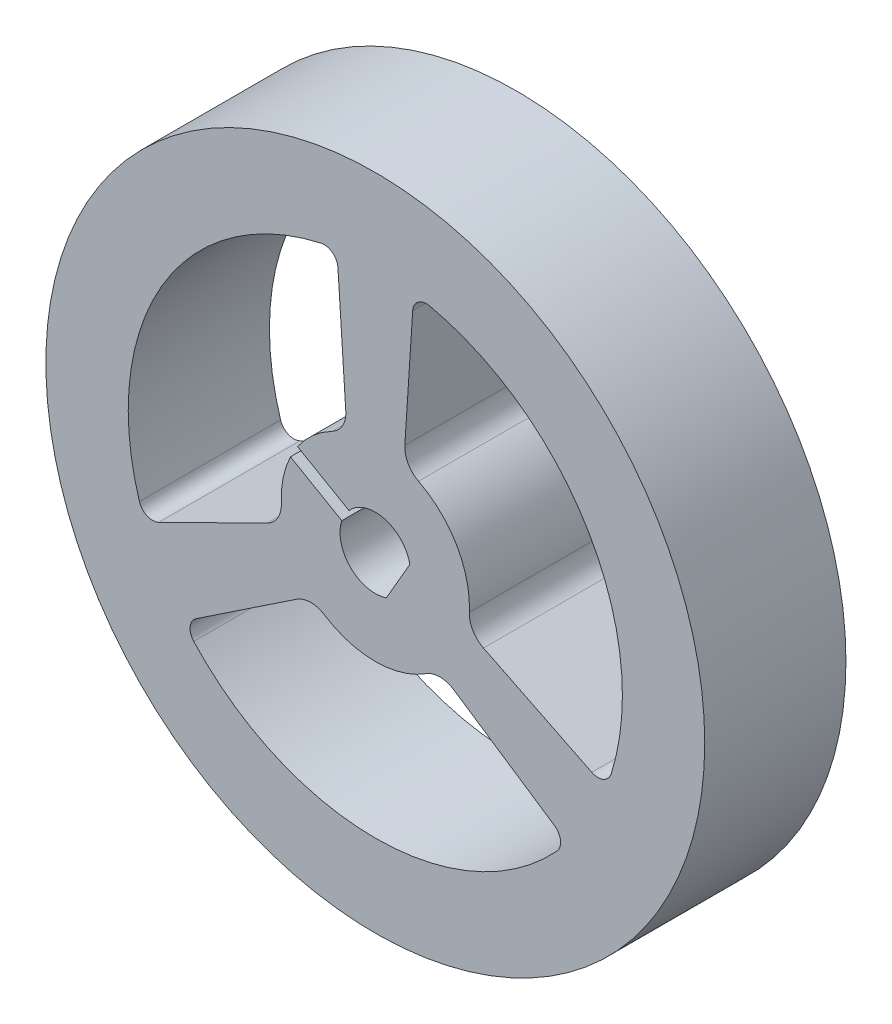
ISO-10303-21;
HEADER;
FILE_DESCRIPTION(('STEP AP214'),'2;1');
FILE_NAME('part.step','',(''),(''),'','','');
FILE_SCHEMA(('AUTOMOTIVE_DESIGN { 1 0 10303 214 1 1 1 1 }'));
ENDSEC;
DATA;
#1=APPLICATION_CONTEXT('core data for automotive mechanical design processes');
#2=APPLICATION_PROTOCOL_DEFINITION('international standard','automotive_design',2000,#1);
#3=PRODUCT_CONTEXT('',#1,'mechanical');
#4=PRODUCT('Part','Part','',(#3));
#5=PRODUCT_RELATED_PRODUCT_CATEGORY('part','',(#4));
#6=PRODUCT_DEFINITION_FORMATION('','',#4);
#7=PRODUCT_DEFINITION_CONTEXT('part definition',#1,'design');
#8=PRODUCT_DEFINITION('design','',#6,#7);
#9=PRODUCT_DEFINITION_SHAPE('','',#8);
#10=(LENGTH_UNIT() NAMED_UNIT(*) SI_UNIT(.MILLI.,.METRE.));
#11=(NAMED_UNIT(*) PLANE_ANGLE_UNIT() SI_UNIT($,.RADIAN.));
#12=(NAMED_UNIT(*) SI_UNIT($,.STERADIAN.) SOLID_ANGLE_UNIT());
#13=UNCERTAINTY_MEASURE_WITH_UNIT(LENGTH_MEASURE(1.E-05),#10,'distance_accuracy_value','');
#14=(GEOMETRIC_REPRESENTATION_CONTEXT(3) GLOBAL_UNCERTAINTY_ASSIGNED_CONTEXT((#13)) GLOBAL_UNIT_ASSIGNED_CONTEXT((#10,
#11,#12)) REPRESENTATION_CONTEXT('',''));
#15=CARTESIAN_POINT('',(0.,0.,0.));
#16=DIRECTION('',(0.,0.,1.));
#17=DIRECTION('',(1.,0.,0.));
#18=AXIS2_PLACEMENT_3D('',#15,#16,#17);
#19=CARTESIAN_POINT('',(0.,0.,6.));
#20=DIRECTION('',(0.,0.,1.));
#21=DIRECTION('',(1.,0.,0.));
#22=AXIS2_PLACEMENT_3D('',#19,#20,#21);
#23=PLANE('',#22);
#24=CARTESIAN_POINT('',(0.,0.,6.));
#25=DIRECTION('',(0.,0.,1.));
#26=DIRECTION('',(1.,0.,0.));
#27=AXIS2_PLACEMENT_3D('',#24,#25,#26);
#28=CIRCLE('',#27,14.);
#29=CARTESIAN_POINT('',(14.,0.,6.));
#30=VERTEX_POINT('',#29);
#31=EDGE_CURVE('E11',#30,#30,#28,.T.);
#32=ORIENTED_EDGE('',*,*,#31,.T.);
#33=EDGE_LOOP('',(#32));
#34=FACE_BOUND('',#33,.T.);
#35=DIRECTION('',(-0.0650528700839006,0.997881818700916,0.));
#36=VECTOR('',#35,1.);
#37=CARTESIAN_POINT('',(-1.25469994287573,4.58371108591973,6.));
#38=LINE('',#37,#36);
#39=CARTESIAN_POINT('',(-1.25469994287573,4.58371108591973,6.));
#40=VERTEX_POINT('',#39);
#41=CARTESIAN_POINT('',(-1.58860741176412,9.70570173602358,6.));
#42=VERTEX_POINT('',#41);
#43=EDGE_CURVE('E359',#40,#42,#38,.T.);
#44=ORIENTED_EDGE('',*,*,#43,.F.);
#45=CARTESIAN_POINT('',(-2.33323358140276,4.51340044657011,6.));
#46=DIRECTION('',(0.,0.,1.));
#47=DIRECTION('',(1.,0.,0.));
#48=AXIS2_PLACEMENT_3D('',#45,#46,#47);
#49=CIRCLE('',#48,1.08082301763059);
#50=CARTESIAN_POINT('',(-1.8368941986811,3.55328294719851,6.));
#51=VERTEX_POINT('',#50);
#52=EDGE_CURVE('E357',#51,#40,#49,.T.);
#53=ORIENTED_EDGE('',*,*,#52,.F.);
#54=CARTESIAN_POINT('',(0.,0.,6.));
#55=DIRECTION('',(0.,0.,-1.));
#56=DIRECTION('',(1.,0.,0.));
#57=AXIS2_PLACEMENT_3D('',#54,#55,#56);
#58=CIRCLE('',#57,4.);
#59=CARTESIAN_POINT('',(-3.30233206686227,2.25712270826669,6.));
#60=VERTEX_POINT('',#59);
#61=EDGE_CURVE('E385',#60,#51,#58,.T.);
#62=ORIENTED_EDGE('',*,*,#61,.F.);
#63=DIRECTION('',(-0.866025403784439,0.5,0.));
#64=VECTOR('',#63,1.);
#65=CARTESIAN_POINT('',(-1.12037928060492,0.99737167976196,6.));
#66=LINE('',#65,#64);
#67=CARTESIAN_POINT('',(-1.12037928060492,0.997371679761959,6.));
#68=VERTEX_POINT('',#67);
#69=EDGE_CURVE('E382',#68,#60,#66,.T.);
#70=ORIENTED_EDGE('',*,*,#69,.F.);
#71=CARTESIAN_POINT('',(0.,0.,6.));
#72=DIRECTION('',(0.,0.,1.));
#73=DIRECTION('',(1.,0.,0.));
#74=AXIS2_PLACEMENT_3D('',#71,#72,#73);
#75=CIRCLE('',#74,1.5);
#76=CARTESIAN_POINT('',(1.46824583655185,0.307008409409491,6.));
#77=VERTEX_POINT('',#76);
#78=EDGE_CURVE('E380',#77,#68,#75,.T.);
#79=ORIENTED_EDGE('',*,*,#78,.F.);
#80=DIRECTION('',(0.5,0.866025403784439,0.));
#81=VECTOR('',#80,1.);
#82=CARTESIAN_POINT('',(1.46824583655185,0.307008409409491,6.));
#83=LINE('',#82,#81);
#84=CARTESIAN_POINT('',(0.468245836551854,-1.42504239815939,6.));
#85=VERTEX_POINT('',#84);
#86=EDGE_CURVE('E378',#85,#77,#83,.T.);
#87=ORIENTED_EDGE('',*,*,#86,.F.);
#88=CARTESIAN_POINT('',(0.,0.,6.));
#89=DIRECTION('',(0.,0.,1.));
#90=DIRECTION('',(1.,0.,0.));
#91=AXIS2_PLACEMENT_3D('',#88,#89,#90);
#92=CIRCLE('',#91,1.5);
#93=CARTESIAN_POINT('',(-1.42393885199148,0.471591078996618,6.));
#94=VERTEX_POINT('',#93);
#95=EDGE_CURVE('E376',#94,#85,#92,.T.);
#96=ORIENTED_EDGE('',*,*,#95,.F.);
#97=DIRECTION('',(0.866025403784438,-0.5,0.));
#98=VECTOR('',#97,1.);
#99=CARTESIAN_POINT('',(-1.42393885199148,0.471591078996618,6.));
#100=LINE('',#99,#98);
#101=CARTESIAN_POINT('',(-3.60589163824882,1.73134210750135,6.));
#102=VERTEX_POINT('',#101);
#103=EDGE_CURVE('E374',#102,#94,#100,.T.);
#104=ORIENTED_EDGE('',*,*,#103,.F.);
#105=CARTESIAN_POINT('',(0.,0.,6.));
#106=DIRECTION('',(0.,0.,-1.));
#107=DIRECTION('',(1.,0.,0.));
#108=AXIS2_PLACEMENT_3D('',#105,#106,#107);
#109=CIRCLE('',#108,4.);
#110=CARTESIAN_POINT('',(-3.9956803984485,-0.185844433477162,6.));
#111=VERTEX_POINT('',#110);
#112=EDGE_CURVE('E372',#111,#102,#109,.T.);
#113=ORIENTED_EDGE('',*,*,#112,.F.);
#114=CARTESIAN_POINT('',(-5.07533623488313,-0.236060668827324,6.));
#115=DIRECTION('',(0.,0.,1.));
#116=DIRECTION('',(-1.,0.,0.));
#117=AXIS2_PLACEMENT_3D('',#114,#115,#116);
#118=CIRCLE('',#117,1.08082301763059);
#119=CARTESIAN_POINT('',(-4.5969602154527,-1.2052535183026,6.));
#120=VERTEX_POINT('',#119);
#121=EDGE_CURVE('E370',#120,#111,#118,.T.);
#122=ORIENTED_EDGE('',*,*,#121,.F.);
#123=DIRECTION('',(0.896717440011561,0.442603471268711,0.));
#124=VECTOR('',#123,1.);
#125=CARTESIAN_POINT('',(-4.5969602154527,-1.2052535183026,6.));
#126=LINE('',#125,#124);
#127=CARTESIAN_POINT('',(-9.19968797083321,-3.47707649278383,6.));
#128=VERTEX_POINT('',#127);
#129=EDGE_CURVE('E368',#128,#120,#126,.T.);
#130=ORIENTED_EDGE('',*,*,#129,.F.);
#131=CARTESIAN_POINT('',(-9.46101968490718,-2.94761678256847,6.));
#132=DIRECTION('',(0.,0.,1.));
#133=DIRECTION('',(-1.,0.,0.));
#134=AXIS2_PLACEMENT_3D('',#131,#132,#133);
#135=CIRCLE('',#134,0.590442079735321);
#136=CARTESIAN_POINT('',(-10.0247364706732,-3.12324489810764,6.));
#137=VERTEX_POINT('',#136);
#138=EDGE_CURVE('E366',#137,#128,#135,.T.);
#139=ORIENTED_EDGE('',*,*,#138,.F.);
#140=CARTESIAN_POINT('',(0.,0.,6.));
#141=DIRECTION('',(0.,0.,1.));
#142=DIRECTION('',(1.,0.,0.));
#143=AXIS2_PLACEMENT_3D('',#140,#141,#142);
#144=CIRCLE('',#143,10.5);
#145=CARTESIAN_POINT('',(-2.30755881133522,10.2432988989011,6.));
#146=VERTEX_POINT('',#145);
#147=EDGE_CURVE('E364',#146,#137,#144,.T.);
#148=ORIENTED_EDGE('',*,*,#147,.F.);
#149=CARTESIAN_POINT('',(-2.17779882812795,9.66729178411849,6.));
#150=DIRECTION('',(0.,0.,1.));
#151=DIRECTION('',(1.,0.,0.));
#152=AXIS2_PLACEMENT_3D('',#149,#150,#151);
#153=CIRCLE('',#152,0.590442079735324);
#154=EDGE_CURVE('E362',#42,#146,#153,.T.);
#155=ORIENTED_EDGE('',*,*,#154,.F.);
#156=EDGE_LOOP('',(#44,#53,#62,#70,#79,#87,#96,#104,#113,#122,#130,#139,#148,#155));
#157=FACE_BOUND('',#156,.T.);
#158=CARTESIAN_POINT('',(5.07533623488313,-0.236060668827315,6.));
#159=DIRECTION('',(0.,0.,1.));
#160=DIRECTION('',(1.,0.,0.));
#161=AXIS2_PLACEMENT_3D('',#158,#159,#160);
#162=CIRCLE('',#161,1.08082301763059);
#163=CARTESIAN_POINT('',(3.9956803984485,-0.18584443347716,6.));
#164=VERTEX_POINT('',#163);
#165=CARTESIAN_POINT('',(4.5969602154527,-1.20525351830259,6.));
#166=VERTEX_POINT('',#165);
#167=EDGE_CURVE('E300',#164,#166,#162,.T.);
#168=ORIENTED_EDGE('',*,*,#167,.F.);
#169=CARTESIAN_POINT('',(0.,0.,6.));
#170=DIRECTION('',(0.,0.,-1.));
#171=DIRECTION('',(1.,0.,0.));
#172=AXIS2_PLACEMENT_3D('',#169,#170,#171);
#173=CIRCLE('',#172,4.);
#174=CARTESIAN_POINT('',(1.8368941986811,3.55328294719851,6.));
#175=VERTEX_POINT('',#174);
#176=EDGE_CURVE('E298',#175,#164,#173,.T.);
#177=ORIENTED_EDGE('',*,*,#176,.F.);
#178=CARTESIAN_POINT('',(2.33323358140276,4.51340044657011,6.));
#179=DIRECTION('',(0.,0.,1.));
#180=DIRECTION('',(-1.,0.,0.));
#181=AXIS2_PLACEMENT_3D('',#178,#179,#180);
#182=CIRCLE('',#181,1.08082301763059);
#183=CARTESIAN_POINT('',(1.25469994287573,4.58371108591973,6.));
#184=VERTEX_POINT('',#183);
#185=EDGE_CURVE('E314',#184,#175,#182,.T.);
#186=ORIENTED_EDGE('',*,*,#185,.F.);
#187=DIRECTION('',(-0.0650528700839006,-0.997881818700916,0.));
#188=VECTOR('',#187,1.);
#189=CARTESIAN_POINT('',(1.25469994287573,4.58371108591973,6.));
#190=LINE('',#189,#188);
#191=CARTESIAN_POINT('',(1.58860741176412,9.70570173602358,6.));
#192=VERTEX_POINT('',#191);
#193=EDGE_CURVE('E311',#192,#184,#190,.T.);
#194=ORIENTED_EDGE('',*,*,#193,.F.);
#195=CARTESIAN_POINT('',(2.17779882812795,9.66729178411849,6.));
#196=DIRECTION('',(0.,0.,1.));
#197=DIRECTION('',(-1.,0.,0.));
#198=AXIS2_PLACEMENT_3D('',#195,#196,#197);
#199=CIRCLE('',#198,0.590442079735324);
#200=CARTESIAN_POINT('',(2.30755881133522,10.2432988989011,6.));
#201=VERTEX_POINT('',#200);
#202=EDGE_CURVE('E309',#201,#192,#199,.T.);
#203=ORIENTED_EDGE('',*,*,#202,.F.);
#204=CARTESIAN_POINT('',(0.,0.,6.));
#205=DIRECTION('',(0.,0.,1.));
#206=DIRECTION('',(1.,0.,0.));
#207=AXIS2_PLACEMENT_3D('',#204,#205,#206);
#208=CIRCLE('',#207,10.5);
#209=CARTESIAN_POINT('',(10.0247364706732,-3.12324489810764,6.));
#210=VERTEX_POINT('',#209);
#211=EDGE_CURVE('E307',#210,#201,#208,.T.);
#212=ORIENTED_EDGE('',*,*,#211,.F.);
#213=CARTESIAN_POINT('',(9.46101968490718,-2.94761678256846,6.));
#214=DIRECTION('',(0.,0.,1.));
#215=DIRECTION('',(1.,0.,0.));
#216=AXIS2_PLACEMENT_3D('',#213,#214,#215);
#217=CIRCLE('',#216,0.590442079735323);
#218=CARTESIAN_POINT('',(9.19968797083321,-3.47707649278382,6.));
#219=VERTEX_POINT('',#218);
#220=EDGE_CURVE('E305',#219,#210,#217,.T.);
#221=ORIENTED_EDGE('',*,*,#220,.F.);
#222=DIRECTION('',(0.896717440011561,-0.442603471268711,0.));
#223=VECTOR('',#222,1.);
#224=CARTESIAN_POINT('',(4.5969602154527,-1.20525351830259,6.));
#225=LINE('',#224,#223);
#226=EDGE_CURVE('E303',#166,#219,#225,.T.);
#227=ORIENTED_EDGE('',*,*,#226,.F.);
#228=EDGE_LOOP('',(#168,#177,#186,#194,#203,#212,#221,#227));
#229=FACE_BOUND('',#228,.T.);
#230=CARTESIAN_POINT('',(-2.74210265348037,-4.2773397777428,6.));
#231=DIRECTION('',(0.,0.,1.));
#232=DIRECTION('',(1.,0.,0.));
#233=AXIS2_PLACEMENT_3D('',#230,#231,#232);
#234=CIRCLE('',#233,1.08082301763059);
#235=CARTESIAN_POINT('',(-2.1587861997674,-3.36743851372135,6.));
#236=VERTEX_POINT('',#235);
#237=CARTESIAN_POINT('',(-3.34226027257697,-3.37845756761713,6.));
#238=VERTEX_POINT('',#237);
#239=EDGE_CURVE('E241',#236,#238,#234,.T.);
#240=ORIENTED_EDGE('',*,*,#239,.F.);
#241=CARTESIAN_POINT('',(0.,0.,6.));
#242=DIRECTION('',(0.,0.,-1.));
#243=DIRECTION('',(1.,0.,0.));
#244=AXIS2_PLACEMENT_3D('',#241,#242,#243);
#245=CIRCLE('',#244,4.);
#246=CARTESIAN_POINT('',(2.1587861997674,-3.36743851372135,6.));
#247=VERTEX_POINT('',#246);
#248=EDGE_CURVE('E233',#247,#236,#245,.T.);
#249=ORIENTED_EDGE('',*,*,#248,.F.);
#250=CARTESIAN_POINT('',(2.74210265348037,-4.27733977774279,6.));
#251=DIRECTION('',(0.,0.,1.));
#252=DIRECTION('',(-1.,0.,0.));
#253=AXIS2_PLACEMENT_3D('',#250,#251,#252);
#254=CIRCLE('',#253,1.08082301763059);
#255=CARTESIAN_POINT('',(3.34226027257697,-3.37845756761713,6.));
#256=VERTEX_POINT('',#255);
#257=EDGE_CURVE('E266',#256,#247,#254,.T.);
#258=ORIENTED_EDGE('',*,*,#257,.F.);
#259=DIRECTION('',(-0.83166456992766,0.555278347432204,0.));
#260=VECTOR('',#259,1.);
#261=CARTESIAN_POINT('',(3.34226027257697,-3.37845756761713,6.));
#262=LINE('',#261,#260);
#263=CARTESIAN_POINT('',(7.6110805590691,-6.22862524323976,6.));
#264=VERTEX_POINT('',#263);
#265=EDGE_CURVE('E264',#264,#256,#262,.T.);
#266=ORIENTED_EDGE('',*,*,#265,.F.);
#267=CARTESIAN_POINT('',(7.28322085677923,-6.71967500155003,6.));
#268=DIRECTION('',(0.,0.,1.));
#269=DIRECTION('',(-1.,0.,0.));
#270=AXIS2_PLACEMENT_3D('',#267,#268,#269);
#271=CIRCLE('',#270,0.590442079735324);
#272=CARTESIAN_POINT('',(7.71717765933794,-7.12005400079349,6.));
#273=VERTEX_POINT('',#272);
#274=EDGE_CURVE('E262',#273,#264,#271,.T.);
#275=ORIENTED_EDGE('',*,*,#274,.F.);
#276=CARTESIAN_POINT('',(0.,0.,6.));
#277=DIRECTION('',(0.,0.,1.));
#278=DIRECTION('',(1.,0.,0.));
#279=AXIS2_PLACEMENT_3D('',#276,#277,#278);
#280=CIRCLE('',#279,10.5);
#281=CARTESIAN_POINT('',(-7.71717765933794,-7.1200540007935,6.));
#282=VERTEX_POINT('',#281);
#283=EDGE_CURVE('E260',#282,#273,#280,.T.);
#284=ORIENTED_EDGE('',*,*,#283,.F.);
#285=CARTESIAN_POINT('',(-7.28322085677923,-6.71967500155004,6.));
#286=DIRECTION('',(0.,0.,1.));
#287=DIRECTION('',(1.,0.,0.));
#288=AXIS2_PLACEMENT_3D('',#285,#286,#287);
#289=CIRCLE('',#288,0.590442079735324);
#290=CARTESIAN_POINT('',(-7.61108055906909,-6.22862524323977,6.));
#291=VERTEX_POINT('',#290);
#292=EDGE_CURVE('E256',#291,#282,#289,.T.);
#293=ORIENTED_EDGE('',*,*,#292,.F.);
#294=DIRECTION('',(-0.83166456992766,-0.555278347432205,0.));
#295=VECTOR('',#294,1.);
#296=CARTESIAN_POINT('',(-3.34226027257697,-3.37845756761713,6.));
#297=LINE('',#296,#295);
#298=EDGE_CURVE('E254',#238,#291,#297,.T.);
#299=ORIENTED_EDGE('',*,*,#298,.F.);
#300=EDGE_LOOP('',(#240,#249,#258,#266,#275,#284,#293,#299));
#301=FACE_BOUND('',#300,.T.);
#302=ADVANCED_FACE('F36',(#34,#157,#229,#301),#23,.T.);
#303=CARTESIAN_POINT('',(0.,0.,0.));
#304=DIRECTION('',(0.,0.,1.));
#305=DIRECTION('',(1.,0.,0.));
#306=AXIS2_PLACEMENT_3D('',#303,#304,#305);
#307=PLANE('',#306);
#308=CARTESIAN_POINT('',(0.,0.,0.));
#309=DIRECTION('',(0.,0.,-1.));
#310=DIRECTION('',(1.,0.,0.));
#311=AXIS2_PLACEMENT_3D('',#308,#309,#310);
#312=CIRCLE('',#311,4.);
#313=CARTESIAN_POINT('',(1.8368941986811,3.55328294719851,0.));
#314=VERTEX_POINT('',#313);
#315=CARTESIAN_POINT('',(3.9956803984485,-0.18584443347716,0.));
#316=VERTEX_POINT('',#315);
#317=EDGE_CURVE('E249',#314,#316,#312,.T.);
#318=ORIENTED_EDGE('',*,*,#317,.T.);
#319=CARTESIAN_POINT('',(5.07533623488313,-0.236060668827315,0.));
#320=DIRECTION('',(0.,0.,1.));
#321=DIRECTION('',(1.,0.,0.));
#322=AXIS2_PLACEMENT_3D('',#319,#320,#321);
#323=CIRCLE('',#322,1.08082301763059);
#324=CARTESIAN_POINT('',(4.5969602154527,-1.20525351830259,0.));
#325=VERTEX_POINT('',#324);
#326=EDGE_CURVE('E319',#316,#325,#323,.T.);
#327=ORIENTED_EDGE('',*,*,#326,.T.);
#328=DIRECTION('',(0.896717440011561,-0.442603471268711,0.));
#329=VECTOR('',#328,1.);
#330=CARTESIAN_POINT('',(4.5969602154527,-1.20525351830259,0.));
#331=LINE('',#330,#329);
#332=CARTESIAN_POINT('',(9.19968797083321,-3.47707649278382,0.));
#333=VERTEX_POINT('',#332);
#334=EDGE_CURVE('E322',#325,#333,#331,.T.);
#335=ORIENTED_EDGE('',*,*,#334,.T.);
#336=CARTESIAN_POINT('',(9.46101968490718,-2.94761678256846,0.));
#337=DIRECTION('',(0.,0.,1.));
#338=DIRECTION('',(1.,0.,0.));
#339=AXIS2_PLACEMENT_3D('',#336,#337,#338);
#340=CIRCLE('',#339,0.590442079735323);
#341=CARTESIAN_POINT('',(10.0247364706732,-3.12324489810764,0.));
#342=VERTEX_POINT('',#341);
#343=EDGE_CURVE('E325',#333,#342,#340,.T.);
#344=ORIENTED_EDGE('',*,*,#343,.T.);
#345=CARTESIAN_POINT('',(0.,0.,0.));
#346=DIRECTION('',(0.,0.,1.));
#347=DIRECTION('',(1.,0.,0.));
#348=AXIS2_PLACEMENT_3D('',#345,#346,#347);
#349=CIRCLE('',#348,10.5);
#350=CARTESIAN_POINT('',(2.30755881133522,10.2432988989011,0.));
#351=VERTEX_POINT('',#350);
#352=EDGE_CURVE('E328',#342,#351,#349,.T.);
#353=ORIENTED_EDGE('',*,*,#352,.T.);
#354=CARTESIAN_POINT('',(2.17779882812795,9.66729178411849,0.));
#355=DIRECTION('',(0.,0.,1.));
#356=DIRECTION('',(-1.,0.,0.));
#357=AXIS2_PLACEMENT_3D('',#354,#355,#356);
#358=CIRCLE('',#357,0.590442079735324);
#359=CARTESIAN_POINT('',(1.58860741176412,9.70570173602358,0.));
#360=VERTEX_POINT('',#359);
#361=EDGE_CURVE('E331',#351,#360,#358,.T.);
#362=ORIENTED_EDGE('',*,*,#361,.T.);
#363=DIRECTION('',(-0.0650528700839006,-0.997881818700916,0.));
#364=VECTOR('',#363,1.);
#365=CARTESIAN_POINT('',(1.25469994287573,4.58371108591973,0.));
#366=LINE('',#365,#364);
#367=CARTESIAN_POINT('',(1.25469994287573,4.58371108591973,0.));
#368=VERTEX_POINT('',#367);
#369=EDGE_CURVE('E334',#360,#368,#366,.T.);
#370=ORIENTED_EDGE('',*,*,#369,.T.);
#371=CARTESIAN_POINT('',(2.33323358140276,4.51340044657011,0.));
#372=DIRECTION('',(0.,0.,1.));
#373=DIRECTION('',(-1.,0.,0.));
#374=AXIS2_PLACEMENT_3D('',#371,#372,#373);
#375=CIRCLE('',#374,1.08082301763059);
#376=EDGE_CURVE('E301',#368,#314,#375,.T.);
#377=ORIENTED_EDGE('',*,*,#376,.T.);
#378=EDGE_LOOP('',(#318,#327,#335,#344,#353,#362,#370,#377));
#379=FACE_BOUND('',#378,.T.);
#380=CARTESIAN_POINT('',(0.,0.,0.));
#381=DIRECTION('',(0.,0.,1.));
#382=DIRECTION('',(1.,0.,0.));
#383=AXIS2_PLACEMENT_3D('',#380,#381,#382);
#384=CIRCLE('',#383,14.);
#385=CARTESIAN_POINT('',(14.,0.,0.));
#386=VERTEX_POINT('',#385);
#387=EDGE_CURVE('E40',#386,#386,#384,.T.);
#388=ORIENTED_EDGE('',*,*,#387,.F.);
#389=EDGE_LOOP('',(#388));
#390=FACE_BOUND('',#389,.T.);
#391=CARTESIAN_POINT('',(-2.33323358140276,4.51340044657011,0.));
#392=DIRECTION('',(0.,0.,1.));
#393=DIRECTION('',(1.,0.,0.));
#394=AXIS2_PLACEMENT_3D('',#391,#392,#393);
#395=CIRCLE('',#394,1.08082301763059);
#396=CARTESIAN_POINT('',(-1.8368941986811,3.55328294719851,0.));
#397=VERTEX_POINT('',#396);
#398=CARTESIAN_POINT('',(-1.25469994287573,4.58371108591973,0.));
#399=VERTEX_POINT('',#398);
#400=EDGE_CURVE('E356',#397,#399,#395,.T.);
#401=ORIENTED_EDGE('',*,*,#400,.T.);
#402=DIRECTION('',(-0.0650528700839006,0.997881818700916,0.));
#403=VECTOR('',#402,1.);
#404=CARTESIAN_POINT('',(-1.25469994287573,4.58371108591973,0.));
#405=LINE('',#404,#403);
#406=CARTESIAN_POINT('',(-1.58860741176412,9.70570173602358,0.));
#407=VERTEX_POINT('',#406);
#408=EDGE_CURVE('E390',#399,#407,#405,.T.);
#409=ORIENTED_EDGE('',*,*,#408,.T.);
#410=CARTESIAN_POINT('',(-2.17779882812795,9.66729178411849,0.));
#411=DIRECTION('',(0.,0.,1.));
#412=DIRECTION('',(1.,0.,0.));
#413=AXIS2_PLACEMENT_3D('',#410,#411,#412);
#414=CIRCLE('',#413,0.590442079735324);
#415=CARTESIAN_POINT('',(-2.30755881133522,10.2432988989011,0.));
#416=VERTEX_POINT('',#415);
#417=EDGE_CURVE('E393',#407,#416,#414,.T.);
#418=ORIENTED_EDGE('',*,*,#417,.T.);
#419=CARTESIAN_POINT('',(0.,0.,0.));
#420=DIRECTION('',(0.,0.,1.));
#421=DIRECTION('',(1.,0.,0.));
#422=AXIS2_PLACEMENT_3D('',#419,#420,#421);
#423=CIRCLE('',#422,10.5);
#424=CARTESIAN_POINT('',(-10.0247364706732,-3.12324489810764,0.));
#425=VERTEX_POINT('',#424);
#426=EDGE_CURVE('E396',#416,#425,#423,.T.);
#427=ORIENTED_EDGE('',*,*,#426,.T.);
#428=CARTESIAN_POINT('',(-9.46101968490718,-2.94761678256847,0.));
#429=DIRECTION('',(0.,0.,1.));
#430=DIRECTION('',(-1.,0.,0.));
#431=AXIS2_PLACEMENT_3D('',#428,#429,#430);
#432=CIRCLE('',#431,0.590442079735321);
#433=CARTESIAN_POINT('',(-9.19968797083321,-3.47707649278383,0.));
#434=VERTEX_POINT('',#433);
#435=EDGE_CURVE('E399',#425,#434,#432,.T.);
#436=ORIENTED_EDGE('',*,*,#435,.T.);
#437=DIRECTION('',(0.896717440011561,0.442603471268711,0.));
#438=VECTOR('',#437,1.);
#439=CARTESIAN_POINT('',(-4.5969602154527,-1.2052535183026,0.));
#440=LINE('',#439,#438);
#441=CARTESIAN_POINT('',(-4.5969602154527,-1.2052535183026,0.));
#442=VERTEX_POINT('',#441);
#443=EDGE_CURVE('E402',#434,#442,#440,.T.);
#444=ORIENTED_EDGE('',*,*,#443,.T.);
#445=CARTESIAN_POINT('',(-5.07533623488313,-0.236060668827324,0.));
#446=DIRECTION('',(0.,0.,1.));
#447=DIRECTION('',(-1.,0.,0.));
#448=AXIS2_PLACEMENT_3D('',#445,#446,#447);
#449=CIRCLE('',#448,1.08082301763059);
#450=CARTESIAN_POINT('',(-3.9956803984485,-0.185844433477162,0.));
#451=VERTEX_POINT('',#450);
#452=EDGE_CURVE('E405',#442,#451,#449,.T.);
#453=ORIENTED_EDGE('',*,*,#452,.T.);
#454=CARTESIAN_POINT('',(0.,0.,0.));
#455=DIRECTION('',(0.,0.,-1.));
#456=DIRECTION('',(1.,0.,0.));
#457=AXIS2_PLACEMENT_3D('',#454,#455,#456);
#458=CIRCLE('',#457,4.);
#459=CARTESIAN_POINT('',(-3.60589163824882,1.73134210750135,0.));
#460=VERTEX_POINT('',#459);
#461=EDGE_CURVE('E408',#451,#460,#458,.T.);
#462=ORIENTED_EDGE('',*,*,#461,.T.);
#463=DIRECTION('',(0.866025403784438,-0.5,0.));
#464=VECTOR('',#463,1.);
#465=CARTESIAN_POINT('',(-1.42393885199148,0.471591078996618,0.));
#466=LINE('',#465,#464);
#467=CARTESIAN_POINT('',(-1.42393885199148,0.471591078996618,0.));
#468=VERTEX_POINT('',#467);
#469=EDGE_CURVE('E411',#460,#468,#466,.T.);
#470=ORIENTED_EDGE('',*,*,#469,.T.);
#471=CARTESIAN_POINT('',(0.,0.,0.));
#472=DIRECTION('',(0.,0.,1.));
#473=DIRECTION('',(1.,0.,0.));
#474=AXIS2_PLACEMENT_3D('',#471,#472,#473);
#475=CIRCLE('',#474,1.5);
#476=CARTESIAN_POINT('',(0.468245836551854,-1.42504239815939,0.));
#477=VERTEX_POINT('',#476);
#478=EDGE_CURVE('E414',#468,#477,#475,.T.);
#479=ORIENTED_EDGE('',*,*,#478,.T.);
#480=DIRECTION('',(0.5,0.866025403784439,0.));
#481=VECTOR('',#480,1.);
#482=CARTESIAN_POINT('',(1.46824583655185,0.307008409409491,0.));
#483=LINE('',#482,#481);
#484=CARTESIAN_POINT('',(1.46824583655185,0.307008409409491,0.));
#485=VERTEX_POINT('',#484);
#486=EDGE_CURVE('E417',#477,#485,#483,.T.);
#487=ORIENTED_EDGE('',*,*,#486,.T.);
#488=CARTESIAN_POINT('',(0.,0.,0.));
#489=DIRECTION('',(0.,0.,1.));
#490=DIRECTION('',(1.,0.,0.));
#491=AXIS2_PLACEMENT_3D('',#488,#489,#490);
#492=CIRCLE('',#491,1.5);
#493=CARTESIAN_POINT('',(-1.12037928060492,0.997371679761959,0.));
#494=VERTEX_POINT('',#493);
#495=EDGE_CURVE('E420',#485,#494,#492,.T.);
#496=ORIENTED_EDGE('',*,*,#495,.T.);
#497=DIRECTION('',(-0.866025403784439,0.5,0.));
#498=VECTOR('',#497,1.);
#499=CARTESIAN_POINT('',(-1.12037928060492,0.99737167976196,0.));
#500=LINE('',#499,#498);
#501=CARTESIAN_POINT('',(-3.30233206686227,2.25712270826669,0.));
#502=VERTEX_POINT('',#501);
#503=EDGE_CURVE('E423',#494,#502,#500,.T.);
#504=ORIENTED_EDGE('',*,*,#503,.T.);
#505=CARTESIAN_POINT('',(0.,0.,0.));
#506=DIRECTION('',(0.,0.,-1.));
#507=DIRECTION('',(1.,0.,0.));
#508=AXIS2_PLACEMENT_3D('',#505,#506,#507);
#509=CIRCLE('',#508,4.);
#510=EDGE_CURVE('E360',#502,#397,#509,.T.);
#511=ORIENTED_EDGE('',*,*,#510,.T.);
#512=EDGE_LOOP('',(#401,#409,#418,#427,#436,#444,#453,#462,#470,#479,#487,#496,#504,#511));
#513=FACE_BOUND('',#512,.T.);
#514=CARTESIAN_POINT('',(0.,0.,0.));
#515=DIRECTION('',(0.,0.,-1.));
#516=DIRECTION('',(1.,0.,0.));
#517=AXIS2_PLACEMENT_3D('',#514,#515,#516);
#518=CIRCLE('',#517,4.);
#519=CARTESIAN_POINT('',(2.1587861997674,-3.36743851372135,0.));
#520=VERTEX_POINT('',#519);
#521=CARTESIAN_POINT('',(-2.1587861997674,-3.36743851372135,0.));
#522=VERTEX_POINT('',#521);
#523=EDGE_CURVE('E59',#520,#522,#518,.T.);
#524=ORIENTED_EDGE('',*,*,#523,.T.);
#525=CARTESIAN_POINT('',(-2.74210265348037,-4.2773397777428,0.));
#526=DIRECTION('',(0.,0.,1.));
#527=DIRECTION('',(1.,0.,0.));
#528=AXIS2_PLACEMENT_3D('',#525,#526,#527);
#529=CIRCLE('',#528,1.08082301763059);
#530=CARTESIAN_POINT('',(-3.34226027257697,-3.37845756761713,0.));
#531=VERTEX_POINT('',#530);
#532=EDGE_CURVE('E248',#522,#531,#529,.T.);
#533=ORIENTED_EDGE('',*,*,#532,.T.);
#534=DIRECTION('',(-0.83166456992766,-0.555278347432205,0.));
#535=VECTOR('',#534,1.);
#536=CARTESIAN_POINT('',(-3.34226027257697,-3.37845756761713,0.));
#537=LINE('',#536,#535);
#538=CARTESIAN_POINT('',(-7.61108055906909,-6.22862524323977,0.));
#539=VERTEX_POINT('',#538);
#540=EDGE_CURVE('E270',#531,#539,#537,.T.);
#541=ORIENTED_EDGE('',*,*,#540,.T.);
#542=CARTESIAN_POINT('',(-7.28322085677923,-6.71967500155004,0.));
#543=DIRECTION('',(0.,0.,1.));
#544=DIRECTION('',(1.,0.,0.));
#545=AXIS2_PLACEMENT_3D('',#542,#543,#544);
#546=CIRCLE('',#545,0.590442079735324);
#547=CARTESIAN_POINT('',(-7.71717765933794,-7.1200540007935,0.));
#548=VERTEX_POINT('',#547);
#549=EDGE_CURVE('E273',#539,#548,#546,.T.);
#550=ORIENTED_EDGE('',*,*,#549,.T.);
#551=CARTESIAN_POINT('',(0.,0.,0.));
#552=DIRECTION('',(0.,0.,1.));
#553=DIRECTION('',(1.,0.,0.));
#554=AXIS2_PLACEMENT_3D('',#551,#552,#553);
#555=CIRCLE('',#554,10.5);
#556=CARTESIAN_POINT('',(7.71717765933794,-7.12005400079349,0.));
#557=VERTEX_POINT('',#556);
#558=EDGE_CURVE('E276',#548,#557,#555,.T.);
#559=ORIENTED_EDGE('',*,*,#558,.T.);
#560=CARTESIAN_POINT('',(7.28322085677923,-6.71967500155003,0.));
#561=DIRECTION('',(0.,0.,1.));
#562=DIRECTION('',(-1.,0.,0.));
#563=AXIS2_PLACEMENT_3D('',#560,#561,#562);
#564=CIRCLE('',#563,0.590442079735324);
#565=CARTESIAN_POINT('',(7.6110805590691,-6.22862524323976,0.));
#566=VERTEX_POINT('',#565);
#567=EDGE_CURVE('E279',#557,#566,#564,.T.);
#568=ORIENTED_EDGE('',*,*,#567,.T.);
#569=DIRECTION('',(-0.83166456992766,0.555278347432204,0.));
#570=VECTOR('',#569,1.);
#571=CARTESIAN_POINT('',(3.34226027257697,-3.37845756761713,0.));
#572=LINE('',#571,#570);
#573=CARTESIAN_POINT('',(3.34226027257697,-3.37845756761713,0.));
#574=VERTEX_POINT('',#573);
#575=EDGE_CURVE('E282',#566,#574,#572,.T.);
#576=ORIENTED_EDGE('',*,*,#575,.T.);
#577=CARTESIAN_POINT('',(2.74210265348037,-4.27733977774279,0.));
#578=DIRECTION('',(0.,0.,1.));
#579=DIRECTION('',(-1.,0.,0.));
#580=AXIS2_PLACEMENT_3D('',#577,#578,#579);
#581=CIRCLE('',#580,1.08082301763059);
#582=EDGE_CURVE('E242',#574,#520,#581,.T.);
#583=ORIENTED_EDGE('',*,*,#582,.T.);
#584=EDGE_LOOP('',(#524,#533,#541,#550,#559,#568,#576,#583));
#585=FACE_BOUND('',#584,.T.);
#586=ADVANCED_FACE('F462',(#379,#390,#513,#585),#307,.F.);
#587=CARTESIAN_POINT('',(0.,0.,6.));
#588=DIRECTION('',(0.,0.,-1.));
#589=DIRECTION('',(-1.,0.,0.));
#590=AXIS2_PLACEMENT_3D('',#587,#588,#589);
#591=CYLINDRICAL_SURFACE('',#590,14.);
#592=ORIENTED_EDGE('',*,*,#31,.F.);
#593=EDGE_LOOP('',(#592));
#594=FACE_BOUND('',#593,.T.);
#595=ORIENTED_EDGE('',*,*,#387,.T.);
#596=EDGE_LOOP('',(#595));
#597=FACE_BOUND('',#596,.T.);
#598=ADVANCED_FACE('F38',(#594,#597),#591,.T.);
#599=CARTESIAN_POINT('',(-2.33323358140276,4.51340044657011,6.));
#600=DIRECTION('',(0.,0.,-1.));
#601=DIRECTION('',(-1.,0.,0.));
#602=AXIS2_PLACEMENT_3D('',#599,#600,#601);
#603=CYLINDRICAL_SURFACE('',#602,1.08082301763059);
#604=ORIENTED_EDGE('',*,*,#400,.F.);
#605=DIRECTION('',(0.,0.,-1.));
#606=VECTOR('',#605,1.);
#607=CARTESIAN_POINT('',(-1.8368941986811,3.55328294719851,6.));
#608=LINE('',#607,#606);
#609=EDGE_CURVE('E387',#51,#397,#608,.T.);
#610=ORIENTED_EDGE('',*,*,#609,.F.);
#611=ORIENTED_EDGE('',*,*,#52,.T.);
#612=DIRECTION('',(0.,0.,-1.));
#613=VECTOR('',#612,1.);
#614=CARTESIAN_POINT('',(-1.25469994287573,4.58371108591973,6.));
#615=LINE('',#614,#613);
#616=EDGE_CURVE('E454',#40,#399,#615,.T.);
#617=ORIENTED_EDGE('',*,*,#616,.T.);
#618=EDGE_LOOP('',(#604,#610,#611,#617));
#619=FACE_BOUND('',#618,.T.);
#620=ADVANCED_FACE('F505',(#619),#603,.F.);
#621=CARTESIAN_POINT('',(-1.25469994287573,4.58371108591973,6.));
#622=DIRECTION('',(-0.997881818700916,-0.0650528700839006,0.));
#623=DIRECTION('',(0.0650528700839006,-0.997881818700916,0.));
#624=AXIS2_PLACEMENT_3D('',#621,#622,#623);
#625=PLANE('',#624);
#626=ORIENTED_EDGE('',*,*,#408,.F.);
#627=ORIENTED_EDGE('',*,*,#616,.F.);
#628=ORIENTED_EDGE('',*,*,#43,.T.);
#629=DIRECTION('',(0.,0.,-1.));
#630=VECTOR('',#629,1.);
#631=CARTESIAN_POINT('',(-1.58860741176412,9.70570173602358,6.));
#632=LINE('',#631,#630);
#633=EDGE_CURVE('E452',#42,#407,#632,.T.);
#634=ORIENTED_EDGE('',*,*,#633,.T.);
#635=EDGE_LOOP('',(#626,#627,#628,#634));
#636=FACE_BOUND('',#635,.T.);
#637=ADVANCED_FACE('F508',(#636),#625,.T.);
#638=CARTESIAN_POINT('',(-2.17779882812795,9.66729178411849,6.));
#639=DIRECTION('',(0.,0.,-1.));
#640=DIRECTION('',(-1.,0.,0.));
#641=AXIS2_PLACEMENT_3D('',#638,#639,#640);
#642=CYLINDRICAL_SURFACE('',#641,0.590442079735324);
#643=ORIENTED_EDGE('',*,*,#417,.F.);
#644=ORIENTED_EDGE('',*,*,#633,.F.);
#645=ORIENTED_EDGE('',*,*,#154,.T.);
#646=DIRECTION('',(0.,0.,-1.));
#647=VECTOR('',#646,1.);
#648=CARTESIAN_POINT('',(-2.30755881133522,10.2432988989011,6.));
#649=LINE('',#648,#647);
#650=EDGE_CURVE('E450',#146,#416,#649,.T.);
#651=ORIENTED_EDGE('',*,*,#650,.T.);
#652=EDGE_LOOP('',(#643,#644,#645,#651));
#653=FACE_BOUND('',#652,.T.);
#654=ADVANCED_FACE('F511',(#653),#642,.F.);
#655=CARTESIAN_POINT('',(0.,0.,6.));
#656=DIRECTION('',(0.,0.,-1.));
#657=DIRECTION('',(-1.,0.,0.));
#658=AXIS2_PLACEMENT_3D('',#655,#656,#657);
#659=CYLINDRICAL_SURFACE('',#658,10.5);
#660=ORIENTED_EDGE('',*,*,#426,.F.);
#661=ORIENTED_EDGE('',*,*,#650,.F.);
#662=ORIENTED_EDGE('',*,*,#147,.T.);
#663=DIRECTION('',(0.,0.,-1.));
#664=VECTOR('',#663,1.);
#665=CARTESIAN_POINT('',(-10.0247364706732,-3.12324489810764,6.));
#666=LINE('',#665,#664);
#667=EDGE_CURVE('E448',#137,#425,#666,.T.);
#668=ORIENTED_EDGE('',*,*,#667,.T.);
#669=EDGE_LOOP('',(#660,#661,#662,#668));
#670=FACE_BOUND('',#669,.T.);
#671=ADVANCED_FACE('F515',(#670),#659,.F.);
#672=CARTESIAN_POINT('',(-9.46101968490718,-2.94761678256847,6.));
#673=DIRECTION('',(0.,0.,-1.));
#674=DIRECTION('',(-1.,0.,0.));
#675=AXIS2_PLACEMENT_3D('',#672,#673,#674);
#676=CYLINDRICAL_SURFACE('',#675,0.590442079735321);
#677=ORIENTED_EDGE('',*,*,#435,.F.);
#678=ORIENTED_EDGE('',*,*,#667,.F.);
#679=ORIENTED_EDGE('',*,*,#138,.T.);
#680=DIRECTION('',(0.,0.,-1.));
#681=VECTOR('',#680,1.);
#682=CARTESIAN_POINT('',(-9.19968797083321,-3.47707649278383,6.));
#683=LINE('',#682,#681);
#684=EDGE_CURVE('E446',#128,#434,#683,.T.);
#685=ORIENTED_EDGE('',*,*,#684,.T.);
#686=EDGE_LOOP('',(#677,#678,#679,#685));
#687=FACE_BOUND('',#686,.T.);
#688=ADVANCED_FACE('F519',(#687),#676,.F.);
#689=CARTESIAN_POINT('',(-4.5969602154527,-1.2052535183026,6.));
#690=DIRECTION('',(-0.442603471268712,0.896717440011561,0.));
#691=DIRECTION('',(-0.896717440011561,-0.442603471268712,0.));
#692=AXIS2_PLACEMENT_3D('',#689,#690,#691);
#693=PLANE('',#692);
#694=ORIENTED_EDGE('',*,*,#443,.F.);
#695=ORIENTED_EDGE('',*,*,#684,.F.);
#696=ORIENTED_EDGE('',*,*,#129,.T.);
#697=DIRECTION('',(0.,0.,-1.));
#698=VECTOR('',#697,1.);
#699=CARTESIAN_POINT('',(-4.5969602154527,-1.2052535183026,6.));
#700=LINE('',#699,#698);
#701=EDGE_CURVE('E444',#120,#442,#700,.T.);
#702=ORIENTED_EDGE('',*,*,#701,.T.);
#703=EDGE_LOOP('',(#694,#695,#696,#702));
#704=FACE_BOUND('',#703,.T.);
#705=ADVANCED_FACE('F523',(#704),#693,.T.);
#706=CARTESIAN_POINT('',(-5.07533623488313,-0.236060668827324,6.));
#707=DIRECTION('',(0.,0.,-1.));
#708=DIRECTION('',(-1.,0.,0.));
#709=AXIS2_PLACEMENT_3D('',#706,#707,#708);
#710=CYLINDRICAL_SURFACE('',#709,1.08082301763059);
#711=ORIENTED_EDGE('',*,*,#452,.F.);
#712=ORIENTED_EDGE('',*,*,#701,.F.);
#713=ORIENTED_EDGE('',*,*,#121,.T.);
#714=DIRECTION('',(0.,0.,-1.));
#715=VECTOR('',#714,1.);
#716=CARTESIAN_POINT('',(-3.9956803984485,-0.185844433477162,6.));
#717=LINE('',#716,#715);
#718=EDGE_CURVE('E442',#111,#451,#717,.T.);
#719=ORIENTED_EDGE('',*,*,#718,.T.);
#720=EDGE_LOOP('',(#711,#712,#713,#719));
#721=FACE_BOUND('',#720,.T.);
#722=ADVANCED_FACE('F527',(#721),#710,.F.);
#723=CARTESIAN_POINT('',(0.,0.,6.));
#724=DIRECTION('',(0.,0.,-1.));
#725=DIRECTION('',(-1.,0.,0.));
#726=AXIS2_PLACEMENT_3D('',#723,#724,#725);
#727=CYLINDRICAL_SURFACE('',#726,4.);
#728=ORIENTED_EDGE('',*,*,#461,.F.);
#729=ORIENTED_EDGE('',*,*,#718,.F.);
#730=ORIENTED_EDGE('',*,*,#112,.T.);
#731=DIRECTION('',(0.,0.,-1.));
#732=VECTOR('',#731,1.);
#733=CARTESIAN_POINT('',(-3.60589163824882,1.73134210750135,6.));
#734=LINE('',#733,#732);
#735=EDGE_CURVE('E440',#102,#460,#734,.T.);
#736=ORIENTED_EDGE('',*,*,#735,.T.);
#737=EDGE_LOOP('',(#728,#729,#730,#736));
#738=FACE_BOUND('',#737,.T.);
#739=ADVANCED_FACE('F531',(#738),#727,.T.);
#740=CARTESIAN_POINT('',(-1.42393885199148,0.471591078996618,6.));
#741=DIRECTION('',(0.5,0.866025403784438,0.));
#742=DIRECTION('',(-0.866025403784438,0.5,0.));
#743=AXIS2_PLACEMENT_3D('',#740,#741,#742);
#744=PLANE('',#743);
#745=ORIENTED_EDGE('',*,*,#469,.F.);
#746=ORIENTED_EDGE('',*,*,#735,.F.);
#747=ORIENTED_EDGE('',*,*,#103,.T.);
#748=DIRECTION('',(0.,0.,-1.));
#749=VECTOR('',#748,1.);
#750=CARTESIAN_POINT('',(-1.42393885199148,0.471591078996618,6.));
#751=LINE('',#750,#749);
#752=EDGE_CURVE('E438',#94,#468,#751,.T.);
#753=ORIENTED_EDGE('',*,*,#752,.T.);
#754=EDGE_LOOP('',(#745,#746,#747,#753));
#755=FACE_BOUND('',#754,.T.);
#756=ADVANCED_FACE('F535',(#755),#744,.T.);
#757=CARTESIAN_POINT('',(0.,0.,6.));
#758=DIRECTION('',(0.,0.,-1.));
#759=DIRECTION('',(-1.,0.,0.));
#760=AXIS2_PLACEMENT_3D('',#757,#758,#759);
#761=CYLINDRICAL_SURFACE('',#760,1.5);
#762=ORIENTED_EDGE('',*,*,#478,.F.);
#763=ORIENTED_EDGE('',*,*,#752,.F.);
#764=ORIENTED_EDGE('',*,*,#95,.T.);
#765=DIRECTION('',(0.,0.,-1.));
#766=VECTOR('',#765,1.);
#767=CARTESIAN_POINT('',(0.468245836551854,-1.42504239815939,6.));
#768=LINE('',#767,#766);
#769=EDGE_CURVE('E436',#85,#477,#768,.T.);
#770=ORIENTED_EDGE('',*,*,#769,.T.);
#771=EDGE_LOOP('',(#762,#763,#764,#770));
#772=FACE_BOUND('',#771,.T.);
#773=ADVANCED_FACE('F539',(#772),#761,.F.);
#774=CARTESIAN_POINT('',(1.46824583655185,0.307008409409491,6.));
#775=DIRECTION('',(-0.866025403784439,0.5,0.));
#776=DIRECTION('',(-0.5,-0.866025403784439,0.));
#777=AXIS2_PLACEMENT_3D('',#774,#775,#776);
#778=PLANE('',#777);
#779=ORIENTED_EDGE('',*,*,#486,.F.);
#780=ORIENTED_EDGE('',*,*,#769,.F.);
#781=ORIENTED_EDGE('',*,*,#86,.T.);
#782=DIRECTION('',(0.,0.,-1.));
#783=VECTOR('',#782,1.);
#784=CARTESIAN_POINT('',(1.46824583655185,0.307008409409491,6.));
#785=LINE('',#784,#783);
#786=EDGE_CURVE('E434',#77,#485,#785,.T.);
#787=ORIENTED_EDGE('',*,*,#786,.T.);
#788=EDGE_LOOP('',(#779,#780,#781,#787));
#789=FACE_BOUND('',#788,.T.);
#790=ADVANCED_FACE('F543',(#789),#778,.T.);
#791=CARTESIAN_POINT('',(0.,0.,6.));
#792=DIRECTION('',(0.,0.,-1.));
#793=DIRECTION('',(-1.,0.,0.));
#794=AXIS2_PLACEMENT_3D('',#791,#792,#793);
#795=CYLINDRICAL_SURFACE('',#794,1.5);
#796=ORIENTED_EDGE('',*,*,#495,.F.);
#797=ORIENTED_EDGE('',*,*,#786,.F.);
#798=ORIENTED_EDGE('',*,*,#78,.T.);
#799=DIRECTION('',(0.,0.,-1.));
#800=VECTOR('',#799,1.);
#801=CARTESIAN_POINT('',(-1.12037928060492,0.997371679761959,6.));
#802=LINE('',#801,#800);
#803=EDGE_CURVE('E432',#68,#494,#802,.T.);
#804=ORIENTED_EDGE('',*,*,#803,.T.);
#805=EDGE_LOOP('',(#796,#797,#798,#804));
#806=FACE_BOUND('',#805,.T.);
#807=ADVANCED_FACE('F547',(#806),#795,.F.);
#808=CARTESIAN_POINT('',(-1.12037928060492,0.99737167976196,6.));
#809=DIRECTION('',(-0.5,-0.866025403784439,0.));
#810=DIRECTION('',(0.866025403784439,-0.5,0.));
#811=AXIS2_PLACEMENT_3D('',#808,#809,#810);
#812=PLANE('',#811);
#813=ORIENTED_EDGE('',*,*,#503,.F.);
#814=ORIENTED_EDGE('',*,*,#803,.F.);
#815=ORIENTED_EDGE('',*,*,#69,.T.);
#816=DIRECTION('',(0.,0.,-1.));
#817=VECTOR('',#816,1.);
#818=CARTESIAN_POINT('',(-3.30233206686227,2.25712270826669,6.));
#819=LINE('',#818,#817);
#820=EDGE_CURVE('E430',#60,#502,#819,.T.);
#821=ORIENTED_EDGE('',*,*,#820,.T.);
#822=EDGE_LOOP('',(#813,#814,#815,#821));
#823=FACE_BOUND('',#822,.T.);
#824=ADVANCED_FACE('F551',(#823),#812,.T.);
#825=CARTESIAN_POINT('',(0.,0.,6.));
#826=DIRECTION('',(0.,0.,-1.));
#827=DIRECTION('',(-1.,0.,0.));
#828=AXIS2_PLACEMENT_3D('',#825,#826,#827);
#829=CYLINDRICAL_SURFACE('',#828,4.);
#830=ORIENTED_EDGE('',*,*,#510,.F.);
#831=ORIENTED_EDGE('',*,*,#820,.F.);
#832=ORIENTED_EDGE('',*,*,#61,.T.);
#833=ORIENTED_EDGE('',*,*,#609,.T.);
#834=EDGE_LOOP('',(#830,#831,#832,#833));
#835=FACE_BOUND('',#834,.T.);
#836=ADVANCED_FACE('F555',(#835),#829,.T.);
#837=CARTESIAN_POINT('',(0.,0.,6.));
#838=DIRECTION('',(0.,0.,-1.));
#839=DIRECTION('',(-1.,0.,0.));
#840=AXIS2_PLACEMENT_3D('',#837,#838,#839);
#841=CYLINDRICAL_SURFACE('',#840,4.);
#842=ORIENTED_EDGE('',*,*,#317,.F.);
#843=DIRECTION('',(0.,0.,-1.));
#844=VECTOR('',#843,1.);
#845=CARTESIAN_POINT('',(1.8368941986811,3.55328294719851,6.));
#846=LINE('',#845,#844);
#847=EDGE_CURVE('E316',#175,#314,#846,.T.);
#848=ORIENTED_EDGE('',*,*,#847,.F.);
#849=ORIENTED_EDGE('',*,*,#176,.T.);
#850=DIRECTION('',(0.,0.,-1.));
#851=VECTOR('',#850,1.);
#852=CARTESIAN_POINT('',(3.9956803984485,-0.18584443347716,6.));
#853=LINE('',#852,#851);
#854=EDGE_CURVE('E353',#164,#316,#853,.T.);
#855=ORIENTED_EDGE('',*,*,#854,.T.);
#856=EDGE_LOOP('',(#842,#848,#849,#855));
#857=FACE_BOUND('',#856,.T.);
#858=ADVANCED_FACE('F559',(#857),#841,.T.);
#859=CARTESIAN_POINT('',(5.07533623488313,-0.236060668827315,6.));
#860=DIRECTION('',(0.,0.,-1.));
#861=DIRECTION('',(-1.,0.,0.));
#862=AXIS2_PLACEMENT_3D('',#859,#860,#861);
#863=CYLINDRICAL_SURFACE('',#862,1.08082301763059);
#864=ORIENTED_EDGE('',*,*,#326,.F.);
#865=ORIENTED_EDGE('',*,*,#854,.F.);
#866=ORIENTED_EDGE('',*,*,#167,.T.);
#867=DIRECTION('',(0.,0.,-1.));
#868=VECTOR('',#867,1.);
#869=CARTESIAN_POINT('',(4.5969602154527,-1.20525351830259,6.));
#870=LINE('',#869,#868);
#871=EDGE_CURVE('E351',#166,#325,#870,.T.);
#872=ORIENTED_EDGE('',*,*,#871,.T.);
#873=EDGE_LOOP('',(#864,#865,#866,#872));
#874=FACE_BOUND('',#873,.T.);
#875=ADVANCED_FACE('F563',(#874),#863,.F.);
#876=CARTESIAN_POINT('',(4.5969602154527,-1.20525351830259,6.));
#877=DIRECTION('',(0.442603471268711,0.896717440011561,0.));
#878=DIRECTION('',(-0.896717440011561,0.442603471268711,0.));
#879=AXIS2_PLACEMENT_3D('',#876,#877,#878);
#880=PLANE('',#879);
#881=ORIENTED_EDGE('',*,*,#334,.F.);
#882=ORIENTED_EDGE('',*,*,#871,.F.);
#883=ORIENTED_EDGE('',*,*,#226,.T.);
#884=DIRECTION('',(0.,0.,-1.));
#885=VECTOR('',#884,1.);
#886=CARTESIAN_POINT('',(9.19968797083321,-3.47707649278382,6.));
#887=LINE('',#886,#885);
#888=EDGE_CURVE('E349',#219,#333,#887,.T.);
#889=ORIENTED_EDGE('',*,*,#888,.T.);
#890=EDGE_LOOP('',(#881,#882,#883,#889));
#891=FACE_BOUND('',#890,.T.);
#892=ADVANCED_FACE('F567',(#891),#880,.T.);
#893=CARTESIAN_POINT('',(9.46101968490718,-2.94761678256846,6.));
#894=DIRECTION('',(0.,0.,-1.));
#895=DIRECTION('',(-1.,0.,0.));
#896=AXIS2_PLACEMENT_3D('',#893,#894,#895);
#897=CYLINDRICAL_SURFACE('',#896,0.590442079735323);
#898=ORIENTED_EDGE('',*,*,#343,.F.);
#899=ORIENTED_EDGE('',*,*,#888,.F.);
#900=ORIENTED_EDGE('',*,*,#220,.T.);
#901=DIRECTION('',(0.,0.,-1.));
#902=VECTOR('',#901,1.);
#903=CARTESIAN_POINT('',(10.0247364706732,-3.12324489810764,6.));
#904=LINE('',#903,#902);
#905=EDGE_CURVE('E347',#210,#342,#904,.T.);
#906=ORIENTED_EDGE('',*,*,#905,.T.);
#907=EDGE_LOOP('',(#898,#899,#900,#906));
#908=FACE_BOUND('',#907,.T.);
#909=ADVANCED_FACE('F571',(#908),#897,.F.);
#910=CARTESIAN_POINT('',(0.,0.,6.));
#911=DIRECTION('',(0.,0.,-1.));
#912=DIRECTION('',(-1.,0.,0.));
#913=AXIS2_PLACEMENT_3D('',#910,#911,#912);
#914=CYLINDRICAL_SURFACE('',#913,10.5);
#915=ORIENTED_EDGE('',*,*,#352,.F.);
#916=ORIENTED_EDGE('',*,*,#905,.F.);
#917=ORIENTED_EDGE('',*,*,#211,.T.);
#918=DIRECTION('',(0.,0.,-1.));
#919=VECTOR('',#918,1.);
#920=CARTESIAN_POINT('',(2.30755881133522,10.2432988989011,6.));
#921=LINE('',#920,#919);
#922=EDGE_CURVE('E345',#201,#351,#921,.T.);
#923=ORIENTED_EDGE('',*,*,#922,.T.);
#924=EDGE_LOOP('',(#915,#916,#917,#923));
#925=FACE_BOUND('',#924,.T.);
#926=ADVANCED_FACE('F575',(#925),#914,.F.);
#927=CARTESIAN_POINT('',(2.17779882812795,9.66729178411849,6.));
#928=DIRECTION('',(0.,0.,-1.));
#929=DIRECTION('',(-1.,0.,0.));
#930=AXIS2_PLACEMENT_3D('',#927,#928,#929);
#931=CYLINDRICAL_SURFACE('',#930,0.590442079735324);
#932=ORIENTED_EDGE('',*,*,#361,.F.);
#933=ORIENTED_EDGE('',*,*,#922,.F.);
#934=ORIENTED_EDGE('',*,*,#202,.T.);
#935=DIRECTION('',(0.,0.,-1.));
#936=VECTOR('',#935,1.);
#937=CARTESIAN_POINT('',(1.58860741176412,9.70570173602358,6.));
#938=LINE('',#937,#936);
#939=EDGE_CURVE('E343',#192,#360,#938,.T.);
#940=ORIENTED_EDGE('',*,*,#939,.T.);
#941=EDGE_LOOP('',(#932,#933,#934,#940));
#942=FACE_BOUND('',#941,.T.);
#943=ADVANCED_FACE('F579',(#942),#931,.F.);
#944=CARTESIAN_POINT('',(1.25469994287573,4.58371108591973,6.));
#945=DIRECTION('',(0.997881818700916,-0.0650528700839006,0.));
#946=DIRECTION('',(0.0650528700839006,0.997881818700916,0.));
#947=AXIS2_PLACEMENT_3D('',#944,#945,#946);
#948=PLANE('',#947);
#949=ORIENTED_EDGE('',*,*,#369,.F.);
#950=ORIENTED_EDGE('',*,*,#939,.F.);
#951=ORIENTED_EDGE('',*,*,#193,.T.);
#952=DIRECTION('',(0.,0.,-1.));
#953=VECTOR('',#952,1.);
#954=CARTESIAN_POINT('',(1.25469994287573,4.58371108591973,6.));
#955=LINE('',#954,#953);
#956=EDGE_CURVE('E341',#184,#368,#955,.T.);
#957=ORIENTED_EDGE('',*,*,#956,.T.);
#958=EDGE_LOOP('',(#949,#950,#951,#957));
#959=FACE_BOUND('',#958,.T.);
#960=ADVANCED_FACE('F583',(#959),#948,.T.);
#961=CARTESIAN_POINT('',(2.33323358140276,4.51340044657011,6.));
#962=DIRECTION('',(0.,0.,-1.));
#963=DIRECTION('',(-1.,0.,0.));
#964=AXIS2_PLACEMENT_3D('',#961,#962,#963);
#965=CYLINDRICAL_SURFACE('',#964,1.08082301763059);
#966=ORIENTED_EDGE('',*,*,#376,.F.);
#967=ORIENTED_EDGE('',*,*,#956,.F.);
#968=ORIENTED_EDGE('',*,*,#185,.T.);
#969=ORIENTED_EDGE('',*,*,#847,.T.);
#970=EDGE_LOOP('',(#966,#967,#968,#969));
#971=FACE_BOUND('',#970,.T.);
#972=ADVANCED_FACE('F587',(#971),#965,.F.);
#973=CARTESIAN_POINT('',(0.,0.,6.));
#974=DIRECTION('',(0.,0.,-1.));
#975=DIRECTION('',(-1.,0.,0.));
#976=AXIS2_PLACEMENT_3D('',#973,#974,#975);
#977=CYLINDRICAL_SURFACE('',#976,4.);
#978=ORIENTED_EDGE('',*,*,#523,.F.);
#979=DIRECTION('',(0.,0.,-1.));
#980=VECTOR('',#979,1.);
#981=CARTESIAN_POINT('',(2.1587861997674,-3.36743851372135,6.));
#982=LINE('',#981,#980);
#983=EDGE_CURVE('E237',#247,#520,#982,.T.);
#984=ORIENTED_EDGE('',*,*,#983,.F.);
#985=ORIENTED_EDGE('',*,*,#248,.T.);
#986=DIRECTION('',(0.,0.,-1.));
#987=VECTOR('',#986,1.);
#988=CARTESIAN_POINT('',(-2.1587861997674,-3.36743851372135,6.));
#989=LINE('',#988,#987);
#990=EDGE_CURVE('E236',#236,#522,#989,.T.);
#991=ORIENTED_EDGE('',*,*,#990,.T.);
#992=EDGE_LOOP('',(#978,#984,#985,#991));
#993=FACE_BOUND('',#992,.T.);
#994=ADVANCED_FACE('F235',(#993),#977,.T.);
#995=CARTESIAN_POINT('',(-2.74210265348037,-4.2773397777428,6.));
#996=DIRECTION('',(0.,0.,-1.));
#997=DIRECTION('',(-1.,0.,0.));
#998=AXIS2_PLACEMENT_3D('',#995,#996,#997);
#999=CYLINDRICAL_SURFACE('',#998,1.08082301763059);
#1000=ORIENTED_EDGE('',*,*,#532,.F.);
#1001=ORIENTED_EDGE('',*,*,#990,.F.);
#1002=ORIENTED_EDGE('',*,*,#239,.T.);
#1003=DIRECTION('',(0.,0.,-1.));
#1004=VECTOR('',#1003,1.);
#1005=CARTESIAN_POINT('',(-3.34226027257697,-3.37845756761713,6.));
#1006=LINE('',#1005,#1004);
#1007=EDGE_CURVE('E250',#238,#531,#1006,.T.);
#1008=ORIENTED_EDGE('',*,*,#1007,.T.);
#1009=EDGE_LOOP('',(#1000,#1001,#1002,#1008));
#1010=FACE_BOUND('',#1009,.T.);
#1011=ADVANCED_FACE('F245',(#1010),#999,.F.);
#1012=CARTESIAN_POINT('',(-3.34226027257697,-3.37845756761713,6.));
#1013=DIRECTION('',(0.555278347432205,-0.83166456992766,0.));
#1014=DIRECTION('',(0.83166456992766,0.555278347432205,0.));
#1015=AXIS2_PLACEMENT_3D('',#1012,#1013,#1014);
#1016=PLANE('',#1015);
#1017=ORIENTED_EDGE('',*,*,#540,.F.);
#1018=ORIENTED_EDGE('',*,*,#1007,.F.);
#1019=ORIENTED_EDGE('',*,*,#298,.T.);
#1020=DIRECTION('',(0.,0.,-1.));
#1021=VECTOR('',#1020,1.);
#1022=CARTESIAN_POINT('',(-7.61108055906909,-6.22862524323977,6.));
#1023=LINE('',#1022,#1021);
#1024=EDGE_CURVE('E295',#291,#539,#1023,.T.);
#1025=ORIENTED_EDGE('',*,*,#1024,.T.);
#1026=EDGE_LOOP('',(#1017,#1018,#1019,#1025));
#1027=FACE_BOUND('',#1026,.T.);
#1028=ADVANCED_FACE('F489',(#1027),#1016,.T.);
#1029=CARTESIAN_POINT('',(-7.28322085677923,-6.71967500155004,6.));
#1030=DIRECTION('',(0.,0.,-1.));
#1031=DIRECTION('',(-1.,0.,0.));
#1032=AXIS2_PLACEMENT_3D('',#1029,#1030,#1031);
#1033=CYLINDRICAL_SURFACE('',#1032,0.590442079735324);
#1034=ORIENTED_EDGE('',*,*,#549,.F.);
#1035=ORIENTED_EDGE('',*,*,#1024,.F.);
#1036=ORIENTED_EDGE('',*,*,#292,.T.);
#1037=DIRECTION('',(0.,0.,-1.));
#1038=VECTOR('',#1037,1.);
#1039=CARTESIAN_POINT('',(-7.71717765933794,-7.1200540007935,6.));
#1040=LINE('',#1039,#1038);
#1041=EDGE_CURVE('E293',#282,#548,#1040,.T.);
#1042=ORIENTED_EDGE('',*,*,#1041,.T.);
#1043=EDGE_LOOP('',(#1034,#1035,#1036,#1042));
#1044=FACE_BOUND('',#1043,.T.);
#1045=ADVANCED_FACE('F486',(#1044),#1033,.F.);
#1046=CARTESIAN_POINT('',(0.,0.,6.));
#1047=DIRECTION('',(0.,0.,-1.));
#1048=DIRECTION('',(-1.,0.,0.));
#1049=AXIS2_PLACEMENT_3D('',#1046,#1047,#1048);
#1050=CYLINDRICAL_SURFACE('',#1049,10.5);
#1051=ORIENTED_EDGE('',*,*,#558,.F.);
#1052=ORIENTED_EDGE('',*,*,#1041,.F.);
#1053=ORIENTED_EDGE('',*,*,#283,.T.);
#1054=DIRECTION('',(0.,0.,-1.));
#1055=VECTOR('',#1054,1.);
#1056=CARTESIAN_POINT('',(7.71717765933794,-7.12005400079349,6.));
#1057=LINE('',#1056,#1055);
#1058=EDGE_CURVE('E291',#273,#557,#1057,.T.);
#1059=ORIENTED_EDGE('',*,*,#1058,.T.);
#1060=EDGE_LOOP('',(#1051,#1052,#1053,#1059));
#1061=FACE_BOUND('',#1060,.T.);
#1062=ADVANCED_FACE('F481',(#1061),#1050,.F.);
#1063=CARTESIAN_POINT('',(7.28322085677923,-6.71967500155003,6.));
#1064=DIRECTION('',(0.,0.,-1.));
#1065=DIRECTION('',(-1.,0.,0.));
#1066=AXIS2_PLACEMENT_3D('',#1063,#1064,#1065);
#1067=CYLINDRICAL_SURFACE('',#1066,0.590442079735324);
#1068=ORIENTED_EDGE('',*,*,#567,.F.);
#1069=ORIENTED_EDGE('',*,*,#1058,.F.);
#1070=ORIENTED_EDGE('',*,*,#274,.T.);
#1071=DIRECTION('',(0.,0.,-1.));
#1072=VECTOR('',#1071,1.);
#1073=CARTESIAN_POINT('',(7.6110805590691,-6.22862524323976,6.));
#1074=LINE('',#1073,#1072);
#1075=EDGE_CURVE('E289',#264,#566,#1074,.T.);
#1076=ORIENTED_EDGE('',*,*,#1075,.T.);
#1077=EDGE_LOOP('',(#1068,#1069,#1070,#1076));
#1078=FACE_BOUND('',#1077,.T.);
#1079=ADVANCED_FACE('F477',(#1078),#1067,.F.);
#1080=CARTESIAN_POINT('',(3.34226027257697,-3.37845756761713,6.));
#1081=DIRECTION('',(-0.555278347432204,-0.83166456992766,0.));
#1082=DIRECTION('',(0.83166456992766,-0.555278347432204,0.));
#1083=AXIS2_PLACEMENT_3D('',#1080,#1081,#1082);
#1084=PLANE('',#1083);
#1085=ORIENTED_EDGE('',*,*,#575,.F.);
#1086=ORIENTED_EDGE('',*,*,#1075,.F.);
#1087=ORIENTED_EDGE('',*,*,#265,.T.);
#1088=DIRECTION('',(0.,0.,-1.));
#1089=VECTOR('',#1088,1.);
#1090=CARTESIAN_POINT('',(3.34226027257697,-3.37845756761713,6.));
#1091=LINE('',#1090,#1089);
#1092=EDGE_CURVE('E51',#256,#574,#1091,.T.);
#1093=ORIENTED_EDGE('',*,*,#1092,.T.);
#1094=EDGE_LOOP('',(#1085,#1086,#1087,#1093));
#1095=FACE_BOUND('',#1094,.T.);
#1096=ADVANCED_FACE('F474',(#1095),#1084,.T.);
#1097=CARTESIAN_POINT('',(2.74210265348037,-4.27733977774279,6.));
#1098=DIRECTION('',(0.,0.,-1.));
#1099=DIRECTION('',(-1.,0.,0.));
#1100=AXIS2_PLACEMENT_3D('',#1097,#1098,#1099);
#1101=CYLINDRICAL_SURFACE('',#1100,1.08082301763059);
#1102=ORIENTED_EDGE('',*,*,#582,.F.);
#1103=ORIENTED_EDGE('',*,*,#1092,.F.);
#1104=ORIENTED_EDGE('',*,*,#257,.T.);
#1105=ORIENTED_EDGE('',*,*,#983,.T.);
#1106=EDGE_LOOP('',(#1102,#1103,#1104,#1105));
#1107=FACE_BOUND('',#1106,.T.);
#1108=ADVANCED_FACE('F468',(#1107),#1101,.F.);
#1109=CLOSED_SHELL('',(#302,#586,#598,#620,#637,#654,#671,#688,#705,#722,#739,#756,#773,#790,
#807,#824,#836,#858,#875,#892,#909,#926,#943,#960,#972,#994,#1011,#1028,#1045,#1062,#1079,#1096,#1108));
#1110=MANIFOLD_SOLID_BREP('B2',#1109);
#1111=ADVANCED_BREP_SHAPE_REPRESENTATION('',(#18,#1110),#14);
#1112=SHAPE_DEFINITION_REPRESENTATION(#9,#1111);
ENDSEC;
END-ISO-10303-21;
